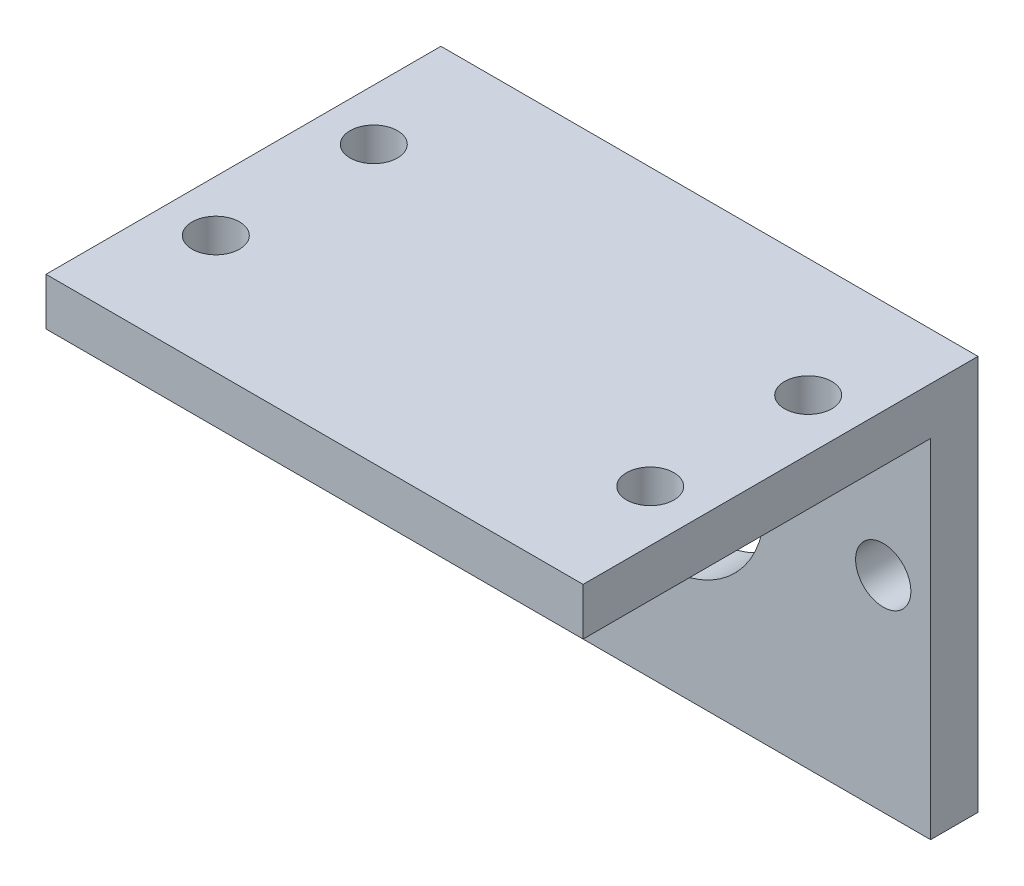
ISO-10303-21;
HEADER;
FILE_DESCRIPTION(('STEP AP214'),'2;1');
FILE_NAME('part.step','',(''),(''),'','','');
FILE_SCHEMA(('AUTOMOTIVE_DESIGN { 1 0 10303 214 1 1 1 1 }'));
ENDSEC;
DATA;
#1=APPLICATION_CONTEXT('core data for automotive mechanical design processes');
#2=APPLICATION_PROTOCOL_DEFINITION('international standard','automotive_design',2000,#1);
#3=PRODUCT_CONTEXT('',#1,'mechanical');
#4=PRODUCT('Part','Part','',(#3));
#5=PRODUCT_RELATED_PRODUCT_CATEGORY('part','',(#4));
#6=PRODUCT_DEFINITION_FORMATION('','',#4);
#7=PRODUCT_DEFINITION_CONTEXT('part definition',#1,'design');
#8=PRODUCT_DEFINITION('design','',#6,#7);
#9=PRODUCT_DEFINITION_SHAPE('','',#8);
#10=(LENGTH_UNIT() NAMED_UNIT(*) SI_UNIT(.MILLI.,.METRE.));
#11=(NAMED_UNIT(*) PLANE_ANGLE_UNIT() SI_UNIT($,.RADIAN.));
#12=(NAMED_UNIT(*) SI_UNIT($,.STERADIAN.) SOLID_ANGLE_UNIT());
#13=UNCERTAINTY_MEASURE_WITH_UNIT(LENGTH_MEASURE(1.E-05),#10,'distance_accuracy_value','');
#14=(GEOMETRIC_REPRESENTATION_CONTEXT(3) GLOBAL_UNCERTAINTY_ASSIGNED_CONTEXT((#13)) GLOBAL_UNIT_ASSIGNED_CONTEXT((#10,
#11,#12)) REPRESENTATION_CONTEXT('',''));
#15=CARTESIAN_POINT('',(0.,0.,0.));
#16=DIRECTION('',(0.,0.,1.));
#17=DIRECTION('',(1.,0.,0.));
#18=AXIS2_PLACEMENT_3D('',#15,#16,#17);
#19=CARTESIAN_POINT('',(0.,6.,0.));
#20=DIRECTION('',(0.,1.,0.));
#21=DIRECTION('',(0.,0.,1.));
#22=AXIS2_PLACEMENT_3D('',#19,#20,#21);
#23=PLANE('',#22);
#24=DIRECTION('',(0.,0.,-1.));
#25=VECTOR('',#24,1.);
#26=CARTESIAN_POINT('',(34.,6.,-50.));
#27=LINE('',#26,#25);
#28=CARTESIAN_POINT('',(34.,6.,0.));
#29=VERTEX_POINT('',#28);
#30=CARTESIAN_POINT('',(34.,6.,-50.));
#31=VERTEX_POINT('',#30);
#32=EDGE_CURVE('E156',#29,#31,#27,.T.);
#33=ORIENTED_EDGE('',*,*,#32,.T.);
#34=DIRECTION('',(-1.,0.,0.));
#35=VECTOR('',#34,1.);
#36=CARTESIAN_POINT('',(-34.,6.,-50.));
#37=LINE('',#36,#35);
#38=CARTESIAN_POINT('',(-34.,6.,-50.));
#39=VERTEX_POINT('',#38);
#40=EDGE_CURVE('E59',#31,#39,#37,.T.);
#41=ORIENTED_EDGE('',*,*,#40,.T.);
#42=DIRECTION('',(0.,0.,1.));
#43=VECTOR('',#42,1.);
#44=CARTESIAN_POINT('',(-34.,6.,-50.));
#45=LINE('',#44,#43);
#46=CARTESIAN_POINT('',(-34.,6.,0.));
#47=VERTEX_POINT('',#46);
#48=EDGE_CURVE('E79',#39,#47,#45,.T.);
#49=ORIENTED_EDGE('',*,*,#48,.T.);
#50=DIRECTION('',(1.,0.,0.));
#51=VECTOR('',#50,1.);
#52=CARTESIAN_POINT('',(-34.,6.,0.));
#53=LINE('',#52,#51);
#54=EDGE_CURVE('E153',#47,#29,#53,.T.);
#55=ORIENTED_EDGE('',*,*,#54,.T.);
#56=EDGE_LOOP('',(#33,#41,#49,#55));
#57=FACE_BOUND('',#56,.T.);
#58=CARTESIAN_POINT('',(-27.5,6.,-15.));
#59=DIRECTION('',(0.,1.,0.));
#60=DIRECTION('',(0.,0.,1.));
#61=AXIS2_PLACEMENT_3D('',#58,#59,#60);
#62=CIRCLE('',#61,3.);
#63=CARTESIAN_POINT('',(-27.5,6.,-12.));
#64=VERTEX_POINT('',#63);
#65=EDGE_CURVE('E134',#64,#64,#62,.T.);
#66=ORIENTED_EDGE('',*,*,#65,.F.);
#67=EDGE_LOOP('',(#66));
#68=FACE_BOUND('',#67,.T.);
#69=CARTESIAN_POINT('',(-27.5,6.,-35.));
#70=DIRECTION('',(0.,1.,0.));
#71=DIRECTION('',(0.,0.,1.));
#72=AXIS2_PLACEMENT_3D('',#69,#70,#71);
#73=CIRCLE('',#72,3.);
#74=CARTESIAN_POINT('',(-27.5,6.,-32.));
#75=VERTEX_POINT('',#74);
#76=EDGE_CURVE('E146',#75,#75,#73,.T.);
#77=ORIENTED_EDGE('',*,*,#76,.F.);
#78=EDGE_LOOP('',(#77));
#79=FACE_BOUND('',#78,.T.);
#80=CARTESIAN_POINT('',(27.5,6.,-35.));
#81=DIRECTION('',(0.,1.,0.));
#82=DIRECTION('',(0.,0.,1.));
#83=AXIS2_PLACEMENT_3D('',#80,#81,#82);
#84=CIRCLE('',#83,3.);
#85=CARTESIAN_POINT('',(27.5,6.,-32.));
#86=VERTEX_POINT('',#85);
#87=EDGE_CURVE('E140',#86,#86,#84,.T.);
#88=ORIENTED_EDGE('',*,*,#87,.F.);
#89=EDGE_LOOP('',(#88));
#90=FACE_BOUND('',#89,.T.);
#91=CARTESIAN_POINT('',(27.5,6.,-15.));
#92=DIRECTION('',(0.,1.,0.));
#93=DIRECTION('',(0.,0.,1.));
#94=AXIS2_PLACEMENT_3D('',#91,#92,#93);
#95=CIRCLE('',#94,3.);
#96=CARTESIAN_POINT('',(27.5,6.,-12.));
#97=VERTEX_POINT('',#96);
#98=EDGE_CURVE('E128',#97,#97,#95,.T.);
#99=ORIENTED_EDGE('',*,*,#98,.F.);
#100=EDGE_LOOP('',(#99));
#101=FACE_BOUND('',#100,.T.);
#102=ADVANCED_FACE('F35',(#57,#68,#79,#90,#101),#23,.T.);
#103=CARTESIAN_POINT('',(0.,0.,0.));
#104=DIRECTION('',(0.,1.,0.));
#105=DIRECTION('',(0.,0.,1.));
#106=AXIS2_PLACEMENT_3D('',#103,#104,#105);
#107=PLANE('',#106);
#108=CARTESIAN_POINT('',(-27.5,0.,-15.));
#109=DIRECTION('',(0.,1.,0.));
#110=DIRECTION('',(0.,0.,1.));
#111=AXIS2_PLACEMENT_3D('',#108,#109,#110);
#112=CIRCLE('',#111,3.);
#113=CARTESIAN_POINT('',(-27.5,0.,-12.));
#114=VERTEX_POINT('',#113);
#115=EDGE_CURVE('E131',#114,#114,#112,.T.);
#116=ORIENTED_EDGE('',*,*,#115,.T.);
#117=EDGE_LOOP('',(#116));
#118=FACE_BOUND('',#117,.T.);
#119=CARTESIAN_POINT('',(-27.5,0.,-35.));
#120=DIRECTION('',(0.,1.,0.));
#121=DIRECTION('',(0.,0.,1.));
#122=AXIS2_PLACEMENT_3D('',#119,#120,#121);
#123=CIRCLE('',#122,3.);
#124=CARTESIAN_POINT('',(-27.5,0.,-32.));
#125=VERTEX_POINT('',#124);
#126=EDGE_CURVE('E143',#125,#125,#123,.T.);
#127=ORIENTED_EDGE('',*,*,#126,.T.);
#128=EDGE_LOOP('',(#127));
#129=FACE_BOUND('',#128,.T.);
#130=DIRECTION('',(0.,0.,1.));
#131=VECTOR('',#130,1.);
#132=CARTESIAN_POINT('',(-34.,0.,-50.));
#133=LINE('',#132,#131);
#134=CARTESIAN_POINT('',(-34.,0.,-44.));
#135=VERTEX_POINT('',#134);
#136=CARTESIAN_POINT('',(-34.,0.,0.));
#137=VERTEX_POINT('',#136);
#138=EDGE_CURVE('E149',#135,#137,#133,.T.);
#139=ORIENTED_EDGE('',*,*,#138,.F.);
#140=DIRECTION('',(1.,0.,0.));
#141=VECTOR('',#140,1.);
#142=CARTESIAN_POINT('',(0.,0.,-44.));
#143=LINE('',#142,#141);
#144=CARTESIAN_POINT('',(34.,0.,-44.));
#145=VERTEX_POINT('',#144);
#146=EDGE_CURVE('E98',#135,#145,#143,.T.);
#147=ORIENTED_EDGE('',*,*,#146,.T.);
#148=DIRECTION('',(0.,0.,-1.));
#149=VECTOR('',#148,1.);
#150=CARTESIAN_POINT('',(34.,0.,-50.));
#151=LINE('',#150,#149);
#152=CARTESIAN_POINT('',(34.,0.,0.));
#153=VERTEX_POINT('',#152);
#154=EDGE_CURVE('E154',#153,#145,#151,.T.);
#155=ORIENTED_EDGE('',*,*,#154,.F.);
#156=DIRECTION('',(1.,0.,0.));
#157=VECTOR('',#156,1.);
#158=CARTESIAN_POINT('',(-34.,0.,0.));
#159=LINE('',#158,#157);
#160=EDGE_CURVE('E74',#137,#153,#159,.T.);
#161=ORIENTED_EDGE('',*,*,#160,.F.);
#162=EDGE_LOOP('',(#139,#147,#155,#161));
#163=FACE_BOUND('',#162,.T.);
#164=CARTESIAN_POINT('',(27.5,0.,-35.));
#165=DIRECTION('',(0.,1.,0.));
#166=DIRECTION('',(0.,0.,1.));
#167=AXIS2_PLACEMENT_3D('',#164,#165,#166);
#168=CIRCLE('',#167,3.);
#169=CARTESIAN_POINT('',(27.5,0.,-32.));
#170=VERTEX_POINT('',#169);
#171=EDGE_CURVE('E137',#170,#170,#168,.T.);
#172=ORIENTED_EDGE('',*,*,#171,.T.);
#173=EDGE_LOOP('',(#172));
#174=FACE_BOUND('',#173,.T.);
#175=CARTESIAN_POINT('',(27.5,0.,-15.));
#176=DIRECTION('',(0.,1.,0.));
#177=DIRECTION('',(0.,0.,1.));
#178=AXIS2_PLACEMENT_3D('',#175,#176,#177);
#179=CIRCLE('',#178,3.);
#180=CARTESIAN_POINT('',(27.5,0.,-12.));
#181=VERTEX_POINT('',#180);
#182=EDGE_CURVE('E127',#181,#181,#179,.T.);
#183=ORIENTED_EDGE('',*,*,#182,.T.);
#184=EDGE_LOOP('',(#183));
#185=FACE_BOUND('',#184,.T.);
#186=ADVANCED_FACE('F171',(#118,#129,#163,#174,#185),#107,.F.);
#187=CARTESIAN_POINT('',(-34.,6.,-50.));
#188=DIRECTION('',(1.,0.,0.));
#189=DIRECTION('',(0.,0.,-1.));
#190=AXIS2_PLACEMENT_3D('',#187,#188,#189);
#191=PLANE('',#190);
#192=DIRECTION('',(0.,-1.,0.));
#193=VECTOR('',#192,1.);
#194=CARTESIAN_POINT('',(-34.,6.,0.));
#195=LINE('',#194,#193);
#196=EDGE_CURVE('E11',#47,#137,#195,.T.);
#197=ORIENTED_EDGE('',*,*,#196,.F.);
#198=ORIENTED_EDGE('',*,*,#48,.F.);
#199=DIRECTION('',(0.,-1.,0.));
#200=VECTOR('',#199,1.);
#201=CARTESIAN_POINT('',(-34.,6.,-50.));
#202=LINE('',#201,#200);
#203=CARTESIAN_POINT('',(-34.,-44.,-50.));
#204=VERTEX_POINT('',#203);
#205=EDGE_CURVE('E115',#39,#204,#202,.T.);
#206=ORIENTED_EDGE('',*,*,#205,.T.);
#207=DIRECTION('',(0.,0.,1.));
#208=VECTOR('',#207,1.);
#209=CARTESIAN_POINT('',(-34.,-44.,-50.));
#210=LINE('',#209,#208);
#211=CARTESIAN_POINT('',(-34.,-44.,-44.));
#212=VERTEX_POINT('',#211);
#213=EDGE_CURVE('E109',#204,#212,#210,.T.);
#214=ORIENTED_EDGE('',*,*,#213,.T.);
#215=DIRECTION('',(0.,1.,0.));
#216=VECTOR('',#215,1.);
#217=CARTESIAN_POINT('',(-34.,-44.,-44.));
#218=LINE('',#217,#216);
#219=EDGE_CURVE('E94',#212,#135,#218,.T.);
#220=ORIENTED_EDGE('',*,*,#219,.T.);
#221=ORIENTED_EDGE('',*,*,#138,.T.);
#222=EDGE_LOOP('',(#197,#198,#206,#214,#220,#221));
#223=FACE_BOUND('',#222,.T.);
#224=ADVANCED_FACE('F37',(#223),#191,.F.);
#225=CARTESIAN_POINT('',(-34.,6.,0.));
#226=DIRECTION('',(0.,0.,-1.));
#227=DIRECTION('',(-1.,0.,0.));
#228=AXIS2_PLACEMENT_3D('',#225,#226,#227);
#229=PLANE('',#228);
#230=ORIENTED_EDGE('',*,*,#160,.T.);
#231=DIRECTION('',(0.,-1.,0.));
#232=VECTOR('',#231,1.);
#233=CARTESIAN_POINT('',(34.,6.,0.));
#234=LINE('',#233,#232);
#235=EDGE_CURVE('E43',#29,#153,#234,.T.);
#236=ORIENTED_EDGE('',*,*,#235,.F.);
#237=ORIENTED_EDGE('',*,*,#54,.F.);
#238=ORIENTED_EDGE('',*,*,#196,.T.);
#239=EDGE_LOOP('',(#230,#236,#237,#238));
#240=FACE_BOUND('',#239,.T.);
#241=ADVANCED_FACE('F173',(#240),#229,.F.);
#242=CARTESIAN_POINT('',(34.,6.,-50.));
#243=DIRECTION('',(-1.,0.,0.));
#244=DIRECTION('',(0.,0.,1.));
#245=AXIS2_PLACEMENT_3D('',#242,#243,#244);
#246=PLANE('',#245);
#247=ORIENTED_EDGE('',*,*,#154,.T.);
#248=DIRECTION('',(0.,1.,0.));
#249=VECTOR('',#248,1.);
#250=CARTESIAN_POINT('',(34.,-44.,-44.));
#251=LINE('',#250,#249);
#252=CARTESIAN_POINT('',(34.,-44.,-44.));
#253=VERTEX_POINT('',#252);
#254=EDGE_CURVE('E50',#253,#145,#251,.T.);
#255=ORIENTED_EDGE('',*,*,#254,.F.);
#256=DIRECTION('',(0.,0.,-1.));
#257=VECTOR('',#256,1.);
#258=CARTESIAN_POINT('',(34.,-44.,-50.));
#259=LINE('',#258,#257);
#260=CARTESIAN_POINT('',(34.,-44.,-50.));
#261=VERTEX_POINT('',#260);
#262=EDGE_CURVE('E112',#253,#261,#259,.T.);
#263=ORIENTED_EDGE('',*,*,#262,.T.);
#264=DIRECTION('',(0.,-1.,0.));
#265=VECTOR('',#264,1.);
#266=CARTESIAN_POINT('',(34.,6.,-50.));
#267=LINE('',#266,#265);
#268=EDGE_CURVE('E164',#31,#261,#267,.T.);
#269=ORIENTED_EDGE('',*,*,#268,.F.);
#270=ORIENTED_EDGE('',*,*,#32,.F.);
#271=ORIENTED_EDGE('',*,*,#235,.T.);
#272=EDGE_LOOP('',(#247,#255,#263,#269,#270,#271));
#273=FACE_BOUND('',#272,.T.);
#274=ADVANCED_FACE('F168',(#273),#246,.F.);
#275=CARTESIAN_POINT('',(-34.,6.,-50.));
#276=DIRECTION('',(0.,0.,1.));
#277=DIRECTION('',(1.,0.,0.));
#278=AXIS2_PLACEMENT_3D('',#275,#276,#277);
#279=PLANE('',#278);
#280=CARTESIAN_POINT('',(-28.,-18.,-50.));
#281=DIRECTION('',(0.,0.,1.));
#282=DIRECTION('',(1.,0.,0.));
#283=AXIS2_PLACEMENT_3D('',#280,#281,#282);
#284=CIRCLE('',#283,3.5);
#285=CARTESIAN_POINT('',(-24.5,-18.,-50.));
#286=VERTEX_POINT('',#285);
#287=EDGE_CURVE('E233',#286,#286,#284,.F.);
#288=ORIENTED_EDGE('',*,*,#287,.F.);
#289=EDGE_LOOP('',(#288));
#290=FACE_BOUND('',#289,.T.);
#291=CARTESIAN_POINT('',(28.,-18.,-50.));
#292=DIRECTION('',(0.,0.,1.));
#293=DIRECTION('',(1.,0.,0.));
#294=AXIS2_PLACEMENT_3D('',#291,#292,#293);
#295=CIRCLE('',#294,3.5);
#296=CARTESIAN_POINT('',(31.5,-18.,-50.));
#297=VERTEX_POINT('',#296);
#298=EDGE_CURVE('E237',#297,#297,#295,.F.);
#299=ORIENTED_EDGE('',*,*,#298,.F.);
#300=EDGE_LOOP('',(#299));
#301=FACE_BOUND('',#300,.T.);
#302=CARTESIAN_POINT('',(0.,-18.,-50.));
#303=DIRECTION('',(0.,0.,1.));
#304=DIRECTION('',(1.,0.,0.));
#305=AXIS2_PLACEMENT_3D('',#302,#303,#304);
#306=CIRCLE('',#305,13.);
#307=CARTESIAN_POINT('',(13.,-18.,-50.));
#308=VERTEX_POINT('',#307);
#309=EDGE_CURVE('E116',#308,#308,#306,.F.);
#310=ORIENTED_EDGE('',*,*,#309,.F.);
#311=EDGE_LOOP('',(#310));
#312=FACE_BOUND('',#311,.T.);
#313=ORIENTED_EDGE('',*,*,#268,.T.);
#314=DIRECTION('',(-1.,0.,0.));
#315=VECTOR('',#314,1.);
#316=CARTESIAN_POINT('',(-34.,-44.,-50.));
#317=LINE('',#316,#315);
#318=EDGE_CURVE('E102',#261,#204,#317,.T.);
#319=ORIENTED_EDGE('',*,*,#318,.T.);
#320=ORIENTED_EDGE('',*,*,#205,.F.);
#321=ORIENTED_EDGE('',*,*,#40,.F.);
#322=EDGE_LOOP('',(#313,#319,#320,#321));
#323=FACE_BOUND('',#322,.T.);
#324=ADVANCED_FACE('F176',(#290,#301,#312,#323),#279,.F.);
#325=CARTESIAN_POINT('',(-27.5,6.,-35.));
#326=DIRECTION('',(0.,-1.,0.));
#327=DIRECTION('',(0.,0.,-1.));
#328=AXIS2_PLACEMENT_3D('',#325,#326,#327);
#329=CYLINDRICAL_SURFACE('',#328,3.);
#330=ORIENTED_EDGE('',*,*,#76,.T.);
#331=EDGE_LOOP('',(#330));
#332=FACE_BOUND('',#331,.T.);
#333=ORIENTED_EDGE('',*,*,#126,.F.);
#334=EDGE_LOOP('',(#333));
#335=FACE_BOUND('',#334,.T.);
#336=ADVANCED_FACE('F178',(#332,#335),#329,.F.);
#337=CARTESIAN_POINT('',(27.5,6.,-35.));
#338=DIRECTION('',(0.,-1.,0.));
#339=DIRECTION('',(0.,0.,-1.));
#340=AXIS2_PLACEMENT_3D('',#337,#338,#339);
#341=CYLINDRICAL_SURFACE('',#340,3.);
#342=ORIENTED_EDGE('',*,*,#87,.T.);
#343=EDGE_LOOP('',(#342));
#344=FACE_BOUND('',#343,.T.);
#345=ORIENTED_EDGE('',*,*,#171,.F.);
#346=EDGE_LOOP('',(#345));
#347=FACE_BOUND('',#346,.T.);
#348=ADVANCED_FACE('F185',(#344,#347),#341,.F.);
#349=CARTESIAN_POINT('',(-27.5,6.,-15.));
#350=DIRECTION('',(0.,-1.,0.));
#351=DIRECTION('',(0.,0.,-1.));
#352=AXIS2_PLACEMENT_3D('',#349,#350,#351);
#353=CYLINDRICAL_SURFACE('',#352,3.);
#354=ORIENTED_EDGE('',*,*,#65,.T.);
#355=EDGE_LOOP('',(#354));
#356=FACE_BOUND('',#355,.T.);
#357=ORIENTED_EDGE('',*,*,#115,.F.);
#358=EDGE_LOOP('',(#357));
#359=FACE_BOUND('',#358,.T.);
#360=ADVANCED_FACE('F201',(#356,#359),#353,.F.);
#361=CARTESIAN_POINT('',(27.5,6.,-15.));
#362=DIRECTION('',(0.,-1.,0.));
#363=DIRECTION('',(0.,0.,-1.));
#364=AXIS2_PLACEMENT_3D('',#361,#362,#363);
#365=CYLINDRICAL_SURFACE('',#364,3.);
#366=ORIENTED_EDGE('',*,*,#98,.T.);
#367=EDGE_LOOP('',(#366));
#368=FACE_BOUND('',#367,.T.);
#369=ORIENTED_EDGE('',*,*,#182,.F.);
#370=EDGE_LOOP('',(#369));
#371=FACE_BOUND('',#370,.T.);
#372=ADVANCED_FACE('F205',(#368,#371),#365,.F.);
#373=CARTESIAN_POINT('',(-34.,-44.,-44.));
#374=DIRECTION('',(0.,0.,1.));
#375=DIRECTION('',(1.,0.,0.));
#376=AXIS2_PLACEMENT_3D('',#373,#374,#375);
#377=PLANE('',#376);
#378=CARTESIAN_POINT('',(-28.,-18.,-44.));
#379=DIRECTION('',(0.,0.,1.));
#380=DIRECTION('',(-1.,0.,0.));
#381=AXIS2_PLACEMENT_3D('',#378,#379,#380);
#382=CIRCLE('',#381,3.5);
#383=CARTESIAN_POINT('',(-31.5,-18.,-44.));
#384=VERTEX_POINT('',#383);
#385=EDGE_CURVE('E231',#384,#384,#382,.T.);
#386=ORIENTED_EDGE('',*,*,#385,.F.);
#387=EDGE_LOOP('',(#386));
#388=FACE_BOUND('',#387,.T.);
#389=CARTESIAN_POINT('',(28.,-18.,-44.));
#390=DIRECTION('',(0.,0.,1.));
#391=DIRECTION('',(1.,0.,0.));
#392=AXIS2_PLACEMENT_3D('',#389,#390,#391);
#393=CIRCLE('',#392,3.5);
#394=CARTESIAN_POINT('',(31.5,-18.,-44.));
#395=VERTEX_POINT('',#394);
#396=EDGE_CURVE('E234',#395,#395,#393,.T.);
#397=ORIENTED_EDGE('',*,*,#396,.F.);
#398=EDGE_LOOP('',(#397));
#399=FACE_BOUND('',#398,.T.);
#400=CARTESIAN_POINT('',(0.,-18.,-44.));
#401=DIRECTION('',(0.,0.,1.));
#402=DIRECTION('',(1.,0.,0.));
#403=AXIS2_PLACEMENT_3D('',#400,#401,#402);
#404=CIRCLE('',#403,13.);
#405=CARTESIAN_POINT('',(13.,-18.,-44.));
#406=VERTEX_POINT('',#405);
#407=EDGE_CURVE('E119',#406,#406,#404,.T.);
#408=ORIENTED_EDGE('',*,*,#407,.F.);
#409=EDGE_LOOP('',(#408));
#410=FACE_BOUND('',#409,.T.);
#411=ORIENTED_EDGE('',*,*,#146,.F.);
#412=ORIENTED_EDGE('',*,*,#219,.F.);
#413=DIRECTION('',(1.,0.,0.));
#414=VECTOR('',#413,1.);
#415=CARTESIAN_POINT('',(-34.,-44.,-44.));
#416=LINE('',#415,#414);
#417=EDGE_CURVE('E97',#212,#253,#416,.T.);
#418=ORIENTED_EDGE('',*,*,#417,.T.);
#419=ORIENTED_EDGE('',*,*,#254,.T.);
#420=EDGE_LOOP('',(#411,#412,#418,#419));
#421=FACE_BOUND('',#420,.T.);
#422=ADVANCED_FACE('F96',(#388,#399,#410,#421),#377,.T.);
#423=CARTESIAN_POINT('',(0.,-44.,0.));
#424=DIRECTION('',(0.,1.,0.));
#425=DIRECTION('',(0.,0.,1.));
#426=AXIS2_PLACEMENT_3D('',#423,#424,#425);
#427=PLANE('',#426);
#428=ORIENTED_EDGE('',*,*,#213,.F.);
#429=ORIENTED_EDGE('',*,*,#318,.F.);
#430=ORIENTED_EDGE('',*,*,#262,.F.);
#431=ORIENTED_EDGE('',*,*,#417,.F.);
#432=EDGE_LOOP('',(#428,#429,#430,#431));
#433=FACE_BOUND('',#432,.T.);
#434=ADVANCED_FACE('F107',(#433),#427,.F.);
#435=CARTESIAN_POINT('',(0.,-18.,-50.001));
#436=DIRECTION('',(0.,0.,1.));
#437=DIRECTION('',(1.,0.,0.));
#438=AXIS2_PLACEMENT_3D('',#435,#436,#437);
#439=CYLINDRICAL_SURFACE('',#438,13.);
#440=ORIENTED_EDGE('',*,*,#407,.T.);
#441=EDGE_LOOP('',(#440));
#442=FACE_BOUND('',#441,.T.);
#443=ORIENTED_EDGE('',*,*,#309,.T.);
#444=EDGE_LOOP('',(#443));
#445=FACE_BOUND('',#444,.T.);
#446=ADVANCED_FACE('F215',(#442,#445),#439,.F.);
#447=CARTESIAN_POINT('',(28.,-18.,-50.001));
#448=DIRECTION('',(0.,0.,1.));
#449=DIRECTION('',(1.,0.,0.));
#450=AXIS2_PLACEMENT_3D('',#447,#448,#449);
#451=CYLINDRICAL_SURFACE('',#450,3.5);
#452=ORIENTED_EDGE('',*,*,#396,.T.);
#453=EDGE_LOOP('',(#452));
#454=FACE_BOUND('',#453,.T.);
#455=ORIENTED_EDGE('',*,*,#298,.T.);
#456=EDGE_LOOP('',(#455));
#457=FACE_BOUND('',#456,.T.);
#458=ADVANCED_FACE('F218',(#454,#457),#451,.F.);
#459=CARTESIAN_POINT('',(-28.,-18.,-50.001));
#460=DIRECTION('',(0.,0.,1.));
#461=DIRECTION('',(1.,0.,0.));
#462=AXIS2_PLACEMENT_3D('',#459,#460,#461);
#463=CYLINDRICAL_SURFACE('',#462,3.5);
#464=ORIENTED_EDGE('',*,*,#385,.T.);
#465=EDGE_LOOP('',(#464));
#466=FACE_BOUND('',#465,.T.);
#467=ORIENTED_EDGE('',*,*,#287,.T.);
#468=EDGE_LOOP('',(#467));
#469=FACE_BOUND('',#468,.T.);
#470=ADVANCED_FACE('F222',(#466,#469),#463,.F.);
#471=CLOSED_SHELL('',(#102,#186,#224,#241,#274,#324,#336,#348,#360,#372,#422,#434,#446,#458,#470));
#472=MANIFOLD_SOLID_BREP('B2',#471);
#473=ADVANCED_BREP_SHAPE_REPRESENTATION('',(#18,#472),#14);
#474=SHAPE_DEFINITION_REPRESENTATION(#9,#473);
ENDSEC;
END-ISO-10303-21;
